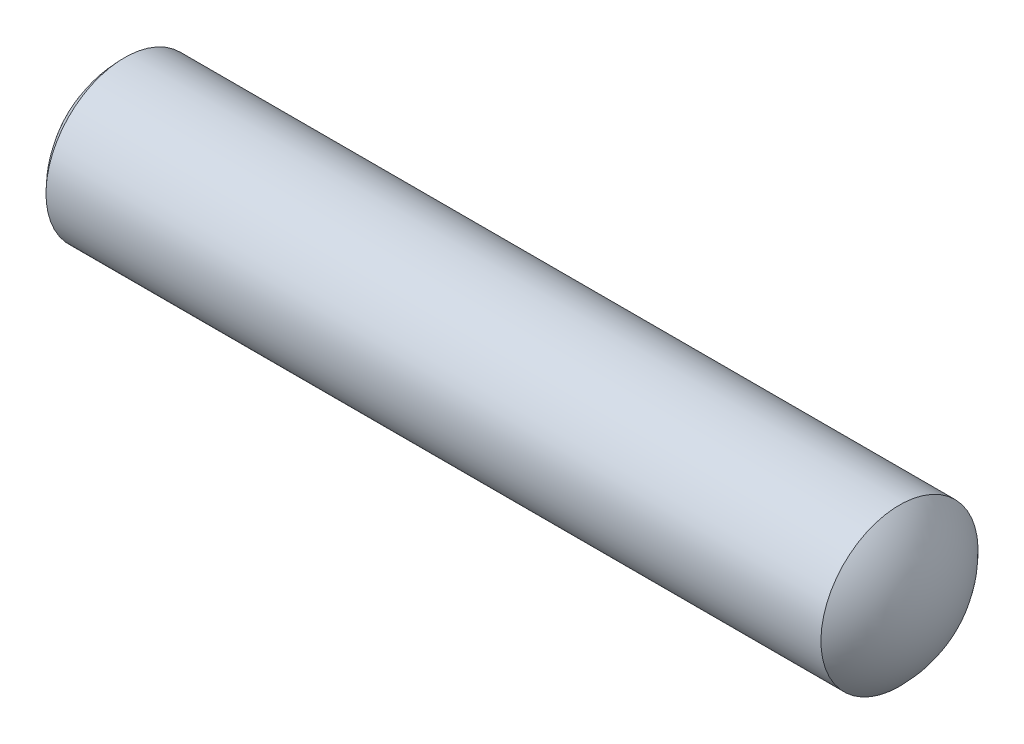
ISO-10303-21;
HEADER;
FILE_DESCRIPTION(('STEP AP214'),'2;1');
FILE_NAME('part.step','',(''),(''),'','','');
FILE_SCHEMA(('AUTOMOTIVE_DESIGN { 1 0 10303 214 1 1 1 1 }'));
ENDSEC;
DATA;
#1=APPLICATION_CONTEXT('core data for automotive mechanical design processes');
#2=APPLICATION_PROTOCOL_DEFINITION('international standard','automotive_design',2000,#1);
#3=PRODUCT_CONTEXT('',#1,'mechanical');
#4=PRODUCT('Part','Part','',(#3));
#5=PRODUCT_RELATED_PRODUCT_CATEGORY('part','',(#4));
#6=PRODUCT_DEFINITION_FORMATION('','',#4);
#7=PRODUCT_DEFINITION_CONTEXT('part definition',#1,'design');
#8=PRODUCT_DEFINITION('design','',#6,#7);
#9=PRODUCT_DEFINITION_SHAPE('','',#8);
#10=(LENGTH_UNIT() NAMED_UNIT(*) SI_UNIT(.MILLI.,.METRE.));
#11=(NAMED_UNIT(*) PLANE_ANGLE_UNIT() SI_UNIT($,.RADIAN.));
#12=(NAMED_UNIT(*) SI_UNIT($,.STERADIAN.) SOLID_ANGLE_UNIT());
#13=UNCERTAINTY_MEASURE_WITH_UNIT(LENGTH_MEASURE(1.E-05),#10,'distance_accuracy_value','');
#14=(GEOMETRIC_REPRESENTATION_CONTEXT(3) GLOBAL_UNCERTAINTY_ASSIGNED_CONTEXT((#13)) GLOBAL_UNIT_ASSIGNED_CONTEXT((#10,
#11,#12)) REPRESENTATION_CONTEXT('',''));
#15=CARTESIAN_POINT('',(0.,0.,0.));
#16=DIRECTION('',(0.,0.,1.));
#17=DIRECTION('',(1.,0.,0.));
#18=AXIS2_PLACEMENT_3D('',#15,#16,#17);
#19=CARTESIAN_POINT('',(15.1875,13.9567193922089,-16.1069128034251));
#20=DIRECTION('',(0.,0.755749574354258,0.654860733945285));
#21=DIRECTION('',(1.,0.,0.));
#22=AXIS2_PLACEMENT_3D('',#19,#20,#21);
#23=SPHERICAL_SURFACE('',#22,1.8375);
#24=CARTESIAN_POINT('',(15.1875,13.9567193922089,-16.1069128034251));
#25=DIRECTION('',(-1.,0.,0.));
#26=DIRECTION('',(0.,-0.654860733945285,0.755749574354258));
#27=AXIS2_PLACEMENT_3D('',#24,#25,#26);
#28=SPHERICAL_SURFACE('',#27,1.8375);
#29=CARTESIAN_POINT('',(16.4734821149612,13.9567193922089,-16.1069128034251));
#30=DIRECTION('',(-1.,0.,0.));
#31=DIRECTION('',(0.,-0.654860733945285,0.755749574354258));
#32=AXIS2_PLACEMENT_3D('',#29,#30,#31);
#33=CIRCLE('',#32,1.3125);
#34=CARTESIAN_POINT('',(16.4734821149612,13.0972146789057,-15.1149914870851));
#35=VERTEX_POINT('',#34);
#36=EDGE_CURVE('E11',#35,#35,#33,.T.);
#37=ORIENTED_EDGE('',*,*,#36,.F.);
#38=EDGE_LOOP('',(#37));
#39=FACE_BOUND('',#38,.T.);
#40=ADVANCED_FACE('F17',(#39),#28,.T.);
#41=CARTESIAN_POINT('',(10.,13.9567193922089,-16.1069128034251));
#42=DIRECTION('',(-1.,0.,0.));
#43=DIRECTION('',(0.,-0.654860733945285,0.755749574354258));
#44=AXIS2_PLACEMENT_3D('',#41,#42,#43);
#45=CYLINDRICAL_SURFACE('',#44,1.3125);
#46=CARTESIAN_POINT('',(3.52651788503884,13.9567193922089,-16.1069128034251));
#47=DIRECTION('',(-1.,0.,0.));
#48=DIRECTION('',(0.,-0.654860733945285,0.755749574354258));
#49=AXIS2_PLACEMENT_3D('',#46,#47,#48);
#50=CIRCLE('',#49,1.3125);
#51=CARTESIAN_POINT('',(3.52651788503884,13.0972146789057,-15.1149914870851));
#52=VERTEX_POINT('',#51);
#53=EDGE_CURVE('E20',#52,#52,#50,.T.);
#54=ORIENTED_EDGE('',*,*,#53,.F.);
#55=EDGE_LOOP('',(#54));
#56=FACE_BOUND('',#55,.T.);
#57=ORIENTED_EDGE('',*,*,#36,.T.);
#58=EDGE_LOOP('',(#57));
#59=FACE_BOUND('',#58,.T.);
#60=ADVANCED_FACE('F47',(#56,#59),#45,.T.);
#61=CARTESIAN_POINT('',(4.8125,13.9567193922089,-16.1069128034251));
#62=DIRECTION('',(0.,0.755749574354258,0.654860733945285));
#63=DIRECTION('',(-1.,0.,0.));
#64=AXIS2_PLACEMENT_3D('',#61,#62,#63);
#65=SPHERICAL_SURFACE('',#64,1.8375);
#66=CARTESIAN_POINT('',(4.8125,13.9567193922089,-16.1069128034251));
#67=DIRECTION('',(-1.,0.,0.));
#68=DIRECTION('',(0.,-0.654860733945285,0.755749574354258));
#69=AXIS2_PLACEMENT_3D('',#66,#67,#68);
#70=SPHERICAL_SURFACE('',#69,1.8375);
#71=ORIENTED_EDGE('',*,*,#53,.T.);
#72=EDGE_LOOP('',(#71));
#73=FACE_BOUND('',#72,.T.);
#74=ADVANCED_FACE('F39',(#73),#70,.T.);
#75=CLOSED_SHELL('',(#40,#60,#74));
#76=MANIFOLD_SOLID_BREP('B1',#75);
#77=ADVANCED_BREP_SHAPE_REPRESENTATION('',(#18,#76),#14);
#78=SHAPE_DEFINITION_REPRESENTATION(#9,#77);
ENDSEC;
END-ISO-10303-21;
